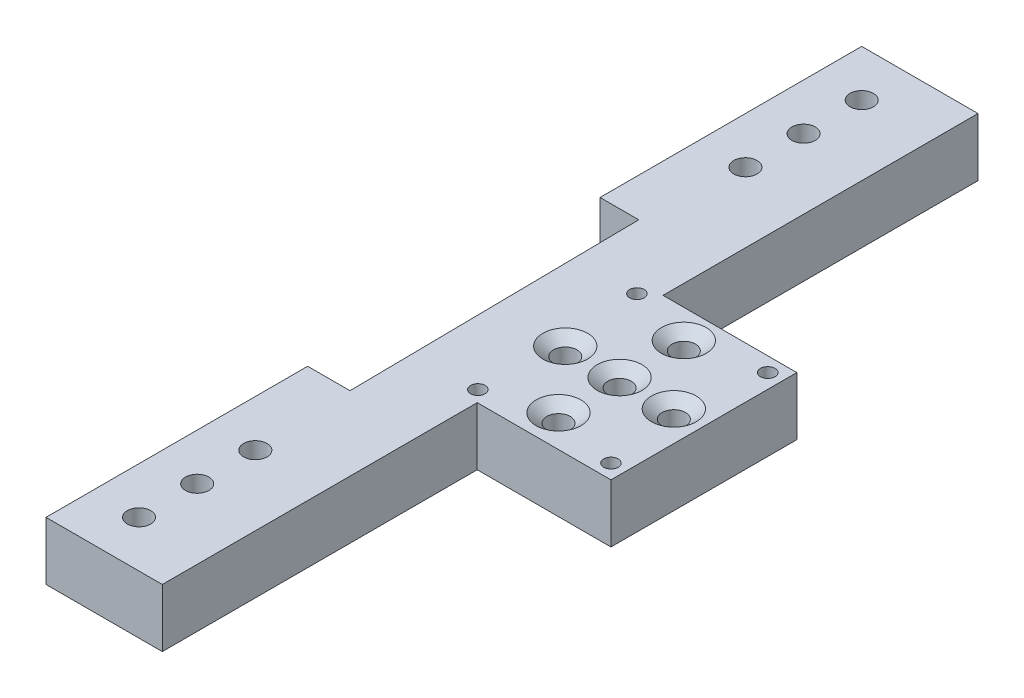
ISO-10303-21;
HEADER;
FILE_DESCRIPTION(('STEP AP214'),'2;1');
FILE_NAME('part.step','',(''),(''),'','','');
FILE_SCHEMA(('AUTOMOTIVE_DESIGN { 1 0 10303 214 1 1 1 1 }'));
ENDSEC;
DATA;
#1=APPLICATION_CONTEXT('core data for automotive mechanical design processes');
#2=APPLICATION_PROTOCOL_DEFINITION('international standard','automotive_design',2000,#1);
#3=PRODUCT_CONTEXT('',#1,'mechanical');
#4=PRODUCT('Part','Part','',(#3));
#5=PRODUCT_RELATED_PRODUCT_CATEGORY('part','',(#4));
#6=PRODUCT_DEFINITION_FORMATION('','',#4);
#7=PRODUCT_DEFINITION_CONTEXT('part definition',#1,'design');
#8=PRODUCT_DEFINITION('design','',#6,#7);
#9=PRODUCT_DEFINITION_SHAPE('','',#8);
#10=(LENGTH_UNIT() NAMED_UNIT(*) SI_UNIT(.MILLI.,.METRE.));
#11=(NAMED_UNIT(*) PLANE_ANGLE_UNIT() SI_UNIT($,.RADIAN.));
#12=(NAMED_UNIT(*) SI_UNIT($,.STERADIAN.) SOLID_ANGLE_UNIT());
#13=UNCERTAINTY_MEASURE_WITH_UNIT(LENGTH_MEASURE(1.E-05),#10,'distance_accuracy_value','');
#14=(GEOMETRIC_REPRESENTATION_CONTEXT(3) GLOBAL_UNCERTAINTY_ASSIGNED_CONTEXT((#13)) GLOBAL_UNIT_ASSIGNED_CONTEXT((#10,
#11,#12)) REPRESENTATION_CONTEXT('',''));
#15=CARTESIAN_POINT('',(0.,0.,0.));
#16=DIRECTION('',(0.,0.,1.));
#17=DIRECTION('',(1.,0.,0.));
#18=AXIS2_PLACEMENT_3D('',#15,#16,#17);
#19=CARTESIAN_POINT('',(0.,12.7,0.));
#20=DIRECTION('',(0.,-1.,0.));
#21=DIRECTION('',(0.,0.,-1.));
#22=AXIS2_PLACEMENT_3D('',#19,#20,#21);
#23=PLANE('',#22);
#24=CARTESIAN_POINT('',(9.37630807243948,12.7,45.9232));
#25=DIRECTION('',(0.,1.,0.));
#26=DIRECTION('',(0.,0.,1.));
#27=AXIS2_PLACEMENT_3D('',#24,#25,#26);
#28=CIRCLE('',#27,2.5527);
#29=CARTESIAN_POINT('',(9.37630807243948,12.7,48.4759));
#30=VERTEX_POINT('',#29);
#31=EDGE_CURVE('E307',#30,#30,#28,.T.);
#32=ORIENTED_EDGE('',*,*,#31,.F.);
#33=EDGE_LOOP('',(#32));
#34=FACE_BOUND('',#33,.T.);
#35=CARTESIAN_POINT('',(9.37630807243948,12.7,-86.5124));
#36=DIRECTION('',(0.,1.,0.));
#37=DIRECTION('',(0.,0.,1.));
#38=AXIS2_PLACEMENT_3D('',#35,#36,#37);
#39=CIRCLE('',#38,2.5527);
#40=CARTESIAN_POINT('',(9.37630807243948,12.7,-83.9597));
#41=VERTEX_POINT('',#40);
#42=EDGE_CURVE('E313',#41,#41,#39,.T.);
#43=ORIENTED_EDGE('',*,*,#42,.F.);
#44=EDGE_LOOP('',(#43));
#45=FACE_BOUND('',#44,.T.);
#46=CARTESIAN_POINT('',(9.37630807243948,12.7,-99.2124));
#47=DIRECTION('',(0.,1.,0.));
#48=DIRECTION('',(0.,0.,1.));
#49=AXIS2_PLACEMENT_3D('',#46,#47,#48);
#50=CIRCLE('',#49,2.5527);
#51=CARTESIAN_POINT('',(9.37630807243948,12.7,-96.6597));
#52=VERTEX_POINT('',#51);
#53=EDGE_CURVE('E325',#52,#52,#50,.T.);
#54=ORIENTED_EDGE('',*,*,#53,.F.);
#55=EDGE_LOOP('',(#54));
#56=FACE_BOUND('',#55,.T.);
#57=DIRECTION('',(0.,0.,-1.));
#58=VECTOR('',#57,1.);
#59=CARTESIAN_POINT('',(24.6163080724395,12.7,0.));
#60=LINE('',#59,#58);
#61=CARTESIAN_POINT('',(24.6163080724395,12.7,68.7832));
#62=VERTEX_POINT('',#61);
#63=CARTESIAN_POINT('',(24.6163080724395,12.7,0.));
#64=VERTEX_POINT('',#63);
#65=EDGE_CURVE('E178',#62,#64,#60,.T.);
#66=ORIENTED_EDGE('',*,*,#65,.T.);
#67=DIRECTION('',(1.,0.,0.));
#68=VECTOR('',#67,1.);
#69=CARTESIAN_POINT('',(24.6163080724395,12.7,0.));
#70=LINE('',#69,#68);
#71=CARTESIAN_POINT('',(53.8263080724395,12.7,0.));
#72=VERTEX_POINT('',#71);
#73=EDGE_CURVE('E106',#64,#72,#70,.T.);
#74=ORIENTED_EDGE('',*,*,#73,.T.);
#75=DIRECTION('',(0.,0.,-1.));
#76=VECTOR('',#75,1.);
#77=CARTESIAN_POINT('',(53.8263080724395,12.7,0.));
#78=LINE('',#77,#76);
#79=CARTESIAN_POINT('',(53.8263080724395,12.7,-40.5892));
#80=VERTEX_POINT('',#79);
#81=EDGE_CURVE('E332',#72,#80,#78,.T.);
#82=ORIENTED_EDGE('',*,*,#81,.T.);
#83=DIRECTION('',(-1.,0.,0.));
#84=VECTOR('',#83,1.);
#85=CARTESIAN_POINT('',(53.8263080724395,12.7,-40.5892));
#86=LINE('',#85,#84);
#87=CARTESIAN_POINT('',(24.6163080724395,12.7,-40.5892));
#88=VERTEX_POINT('',#87);
#89=EDGE_CURVE('E334',#80,#88,#86,.T.);
#90=ORIENTED_EDGE('',*,*,#89,.T.);
#91=DIRECTION('',(0.,0.,-1.));
#92=VECTOR('',#91,1.);
#93=CARTESIAN_POINT('',(24.6163080724395,12.7,-40.5892));
#94=LINE('',#93,#92);
#95=CARTESIAN_POINT('',(24.6163080724395,12.7,-109.3724));
#96=VERTEX_POINT('',#95);
#97=EDGE_CURVE('E336',#88,#96,#94,.T.);
#98=ORIENTED_EDGE('',*,*,#97,.T.);
#99=DIRECTION('',(-1.,0.,0.));
#100=VECTOR('',#99,1.);
#101=CARTESIAN_POINT('',(24.6163080724395,12.7,-109.3724));
#102=LINE('',#101,#100);
#103=CARTESIAN_POINT('',(-0.783691927560525,12.7,-109.3724));
#104=VERTEX_POINT('',#103);
#105=EDGE_CURVE('E338',#96,#104,#102,.T.);
#106=ORIENTED_EDGE('',*,*,#105,.T.);
#107=DIRECTION('',(0.,0.,1.));
#108=VECTOR('',#107,1.);
#109=CARTESIAN_POINT('',(-0.783691927560525,12.7,-109.3724));
#110=LINE('',#109,#108);
#111=CARTESIAN_POINT('',(-0.783691927560517,12.7,-52.2224));
#112=VERTEX_POINT('',#111);
#113=EDGE_CURVE('E340',#104,#112,#110,.T.);
#114=ORIENTED_EDGE('',*,*,#113,.T.);
#115=DIRECTION('',(1.,0.,0.));
#116=VECTOR('',#115,1.);
#117=CARTESIAN_POINT('',(-0.783691927560517,12.7,-52.2224));
#118=LINE('',#117,#116);
#119=CARTESIAN_POINT('',(7.67450807243948,12.7,-52.2224));
#120=VERTEX_POINT('',#119);
#121=EDGE_CURVE('E342',#112,#120,#118,.T.);
#122=ORIENTED_EDGE('',*,*,#121,.T.);
#123=DIRECTION('',(0.0122719528594568,0.,0.999924696751218));
#124=VECTOR('',#123,1.);
#125=CARTESIAN_POINT('',(7.67450807243948,12.7,-52.2224));
#126=LINE('',#125,#124);
#127=CARTESIAN_POINT('',(8.4582,12.7,11.6332));
#128=VERTEX_POINT('',#127);
#129=EDGE_CURVE('E137',#120,#128,#126,.T.);
#130=ORIENTED_EDGE('',*,*,#129,.T.);
#131=DIRECTION('',(-1.,0.,0.));
#132=VECTOR('',#131,1.);
#133=CARTESIAN_POINT('',(-0.783691927560518,12.7,11.6332));
#134=LINE('',#133,#132);
#135=CARTESIAN_POINT('',(-0.783691927560518,12.7,11.6332));
#136=VERTEX_POINT('',#135);
#137=EDGE_CURVE('E131',#128,#136,#134,.T.);
#138=ORIENTED_EDGE('',*,*,#137,.T.);
#139=DIRECTION('',(0.,0.,1.));
#140=VECTOR('',#139,1.);
#141=CARTESIAN_POINT('',(-0.783691927560518,12.7,68.7832));
#142=LINE('',#141,#140);
#143=CARTESIAN_POINT('',(-0.783691927560518,12.7,68.7832));
#144=VERTEX_POINT('',#143);
#145=EDGE_CURVE('E135',#136,#144,#142,.T.);
#146=ORIENTED_EDGE('',*,*,#145,.T.);
#147=DIRECTION('',(1.,0.,0.));
#148=VECTOR('',#147,1.);
#149=CARTESIAN_POINT('',(24.6163080724395,12.7,68.7832));
#150=LINE('',#149,#148);
#151=EDGE_CURVE('E50',#144,#62,#150,.T.);
#152=ORIENTED_EDGE('',*,*,#151,.T.);
#153=EDGE_LOOP('',(#66,#74,#82,#90,#98,#106,#114,#122,#130,#138,#146,#152));
#154=FACE_BOUND('',#153,.T.);
#155=CARTESIAN_POINT('',(9.37630807243948,12.7,58.6232));
#156=DIRECTION('',(0.,1.,0.));
#157=DIRECTION('',(0.,0.,1.));
#158=AXIS2_PLACEMENT_3D('',#155,#156,#157);
#159=CIRCLE('',#158,2.5527);
#160=CARTESIAN_POINT('',(9.37630807243948,12.7,61.1759));
#161=VERTEX_POINT('',#160);
#162=EDGE_CURVE('E319',#161,#161,#159,.T.);
#163=ORIENTED_EDGE('',*,*,#162,.F.);
#164=EDGE_LOOP('',(#163));
#165=FACE_BOUND('',#164,.T.);
#166=CARTESIAN_POINT('',(9.37630807243948,12.7,-73.8124));
#167=DIRECTION('',(0.,1.,0.));
#168=DIRECTION('',(0.,0.,1.));
#169=AXIS2_PLACEMENT_3D('',#166,#167,#168);
#170=CIRCLE('',#169,2.5527);
#171=CARTESIAN_POINT('',(9.37630807243948,12.7,-71.2597));
#172=VERTEX_POINT('',#171);
#173=EDGE_CURVE('E205',#172,#172,#170,.T.);
#174=ORIENTED_EDGE('',*,*,#173,.F.);
#175=EDGE_LOOP('',(#174));
#176=FACE_BOUND('',#175,.T.);
#177=CARTESIAN_POINT('',(9.37630807243948,12.7,33.2232));
#178=DIRECTION('',(0.,1.,0.));
#179=DIRECTION('',(0.,0.,1.));
#180=AXIS2_PLACEMENT_3D('',#177,#178,#179);
#181=CIRCLE('',#180,2.5527);
#182=CARTESIAN_POINT('',(9.37630807243948,12.7,35.7759));
#183=VERTEX_POINT('',#182);
#184=EDGE_CURVE('E42',#183,#183,#181,.T.);
#185=ORIENTED_EDGE('',*,*,#184,.F.);
#186=EDGE_LOOP('',(#185));
#187=FACE_BOUND('',#186,.T.);
#188=CARTESIAN_POINT('',(35.4113080724395,12.7,-6.9607434886059));
#189=DIRECTION('',(0.,1.,0.));
#190=DIRECTION('',(0.,0.,1.));
#191=AXIS2_PLACEMENT_3D('',#188,#189,#190);
#192=CIRCLE('',#191,4.8895);
#193=CARTESIAN_POINT('',(35.4113080724395,12.7,-2.07124348860591));
#194=VERTEX_POINT('',#193);
#195=EDGE_CURVE('E222',#194,#194,#192,.T.);
#196=ORIENTED_EDGE('',*,*,#195,.F.);
#197=EDGE_LOOP('',(#196));
#198=FACE_BOUND('',#197,.T.);
#199=CARTESIAN_POINT('',(35.4113080724395,12.7,-34.3261735415921));
#200=DIRECTION('',(0.,1.,0.));
#201=DIRECTION('',(0.,0.,1.));
#202=AXIS2_PLACEMENT_3D('',#199,#200,#201);
#203=CIRCLE('',#202,4.8895);
#204=CARTESIAN_POINT('',(35.4113080724395,12.7,-29.4366735415921));
#205=VERTEX_POINT('',#204);
#206=EDGE_CURVE('E226',#205,#205,#203,.T.);
#207=ORIENTED_EDGE('',*,*,#206,.F.);
#208=EDGE_LOOP('',(#207));
#209=FACE_BOUND('',#208,.T.);
#210=CARTESIAN_POINT('',(35.4113080724395,12.7,-20.2946));
#211=DIRECTION('',(0.,1.,0.));
#212=DIRECTION('',(0.,0.,1.));
#213=AXIS2_PLACEMENT_3D('',#210,#211,#212);
#214=CIRCLE('',#213,4.8895);
#215=CARTESIAN_POINT('',(35.4113080724395,12.7,-15.4051));
#216=VERTEX_POINT('',#215);
#217=EDGE_CURVE('E230',#216,#216,#214,.T.);
#218=ORIENTED_EDGE('',*,*,#217,.F.);
#219=EDGE_LOOP('',(#218));
#220=FACE_BOUND('',#219,.T.);
#221=CARTESIAN_POINT('',(50.6513080724395,12.7,-37.4142));
#222=DIRECTION('',(0.,1.,0.));
#223=DIRECTION('',(0.,0.,1.));
#224=AXIS2_PLACEMENT_3D('',#221,#222,#223);
#225=CIRCLE('',#224,1.58749999999999);
#226=CARTESIAN_POINT('',(50.6513080724395,12.7,-35.8267));
#227=VERTEX_POINT('',#226);
#228=EDGE_CURVE('E234',#227,#227,#225,.T.);
#229=ORIENTED_EDGE('',*,*,#228,.F.);
#230=EDGE_LOOP('',(#229));
#231=FACE_BOUND('',#230,.T.);
#232=CARTESIAN_POINT('',(50.6513080724395,12.7,-3.175));
#233=DIRECTION('',(0.,1.,0.));
#234=DIRECTION('',(0.,0.,1.));
#235=AXIS2_PLACEMENT_3D('',#232,#233,#234);
#236=CIRCLE('',#235,1.58749999999999);
#237=CARTESIAN_POINT('',(50.6513080724395,12.7,-1.58750000000001));
#238=VERTEX_POINT('',#237);
#239=EDGE_CURVE('E238',#238,#238,#236,.T.);
#240=ORIENTED_EDGE('',*,*,#239,.F.);
#241=EDGE_LOOP('',(#240));
#242=FACE_BOUND('',#241,.T.);
#243=CARTESIAN_POINT('',(22.2141780289218,12.7,-2.54));
#244=DIRECTION('',(0.,1.,0.));
#245=DIRECTION('',(0.,0.,1.));
#246=AXIS2_PLACEMENT_3D('',#243,#244,#245);
#247=CIRCLE('',#246,1.58749999999999);
#248=CARTESIAN_POINT('',(22.2141780289218,12.7,-0.952500000000012));
#249=VERTEX_POINT('',#248);
#250=EDGE_CURVE('E242',#249,#249,#247,.T.);
#251=ORIENTED_EDGE('',*,*,#250,.F.);
#252=EDGE_LOOP('',(#251));
#253=FACE_BOUND('',#252,.T.);
#254=CARTESIAN_POINT('',(21.4413080724395,12.7,-38.0492));
#255=DIRECTION('',(0.,1.,0.));
#256=DIRECTION('',(0.,0.,1.));
#257=AXIS2_PLACEMENT_3D('',#254,#255,#256);
#258=CIRCLE('',#257,1.58749999999999);
#259=CARTESIAN_POINT('',(21.4413080724395,12.7,-36.4617));
#260=VERTEX_POINT('',#259);
#261=EDGE_CURVE('E246',#260,#260,#258,.T.);
#262=ORIENTED_EDGE('',*,*,#261,.F.);
#263=EDGE_LOOP('',(#262));
#264=FACE_BOUND('',#263,.T.);
#265=CARTESIAN_POINT('',(23.5448445186226,12.7,-20.2946));
#266=DIRECTION('',(0.,1.,0.));
#267=DIRECTION('',(0.,0.,1.));
#268=AXIS2_PLACEMENT_3D('',#265,#266,#267);
#269=CIRCLE('',#268,4.8895);
#270=CARTESIAN_POINT('',(23.5448445186226,12.7,-15.4051));
#271=VERTEX_POINT('',#270);
#272=EDGE_CURVE('E250',#271,#271,#269,.T.);
#273=ORIENTED_EDGE('',*,*,#272,.F.);
#274=EDGE_LOOP('',(#273));
#275=FACE_BOUND('',#274,.T.);
#276=CARTESIAN_POINT('',(47.2605410846303,12.7,-20.2946));
#277=DIRECTION('',(0.,1.,0.));
#278=DIRECTION('',(0.,0.,1.));
#279=AXIS2_PLACEMENT_3D('',#276,#277,#278);
#280=CIRCLE('',#279,4.8895);
#281=CARTESIAN_POINT('',(47.2605410846303,12.7,-15.4051));
#282=VERTEX_POINT('',#281);
#283=EDGE_CURVE('E253',#282,#282,#280,.T.);
#284=ORIENTED_EDGE('',*,*,#283,.F.);
#285=EDGE_LOOP('',(#284));
#286=FACE_BOUND('',#285,.T.);
#287=ADVANCED_FACE('F33',(#34,#45,#56,#154,#165,#176,#187,#198,#209,#220,#231,#242,#253,#264,
#275,#286),#23,.F.);
#288=CARTESIAN_POINT('',(9.37630807243948,12.7,33.2232));
#289=DIRECTION('',(0.,1.,0.));
#290=DIRECTION('',(0.,0.,1.));
#291=AXIS2_PLACEMENT_3D('',#288,#289,#290);
#292=CYLINDRICAL_SURFACE('',#291,2.5527);
#293=ORIENTED_EDGE('',*,*,#184,.T.);
#294=EDGE_LOOP('',(#293));
#295=FACE_BOUND('',#294,.T.);
#296=CARTESIAN_POINT('',(9.37630807243948,0.,33.2232));
#297=DIRECTION('',(0.,-1.,0.));
#298=DIRECTION('',(0.,0.,-1.));
#299=AXIS2_PLACEMENT_3D('',#296,#297,#298);
#300=CIRCLE('',#299,2.5527);
#301=CARTESIAN_POINT('',(9.37630807243948,0.,30.6705));
#302=VERTEX_POINT('',#301);
#303=EDGE_CURVE('E11',#302,#302,#300,.T.);
#304=ORIENTED_EDGE('',*,*,#303,.T.);
#305=EDGE_LOOP('',(#304));
#306=FACE_BOUND('',#305,.T.);
#307=ADVANCED_FACE('F35',(#295,#306),#292,.F.);
#308=CARTESIAN_POINT('',(9.37630807243948,12.7,-73.8124));
#309=DIRECTION('',(0.,1.,0.));
#310=DIRECTION('',(0.,0.,1.));
#311=AXIS2_PLACEMENT_3D('',#308,#309,#310);
#312=CYLINDRICAL_SURFACE('',#311,2.5527);
#313=ORIENTED_EDGE('',*,*,#173,.T.);
#314=EDGE_LOOP('',(#313));
#315=FACE_BOUND('',#314,.T.);
#316=CARTESIAN_POINT('',(9.37630807243948,0.,-73.8124));
#317=DIRECTION('',(0.,-1.,0.));
#318=DIRECTION('',(0.,0.,-1.));
#319=AXIS2_PLACEMENT_3D('',#316,#317,#318);
#320=CIRCLE('',#319,2.5527);
#321=CARTESIAN_POINT('',(9.37630807243948,0.,-76.3651));
#322=VERTEX_POINT('',#321);
#323=EDGE_CURVE('E208',#322,#322,#320,.T.);
#324=ORIENTED_EDGE('',*,*,#323,.T.);
#325=EDGE_LOOP('',(#324));
#326=FACE_BOUND('',#325,.T.);
#327=ADVANCED_FACE('F404',(#315,#326),#312,.F.);
#328=CARTESIAN_POINT('',(24.6163080724395,12.7,0.));
#329=DIRECTION('',(-1.,0.,0.));
#330=DIRECTION('',(0.,0.,1.));
#331=AXIS2_PLACEMENT_3D('',#328,#329,#330);
#332=PLANE('',#331);
#333=DIRECTION('',(0.,0.,-1.));
#334=VECTOR('',#333,1.);
#335=CARTESIAN_POINT('',(24.6163080724395,0.,0.));
#336=LINE('',#335,#334);
#337=CARTESIAN_POINT('',(24.6163080724395,0.,68.7832));
#338=VERTEX_POINT('',#337);
#339=CARTESIAN_POINT('',(24.6163080724395,0.,0.));
#340=VERTEX_POINT('',#339);
#341=EDGE_CURVE('E155',#338,#340,#336,.T.);
#342=ORIENTED_EDGE('',*,*,#341,.T.);
#343=DIRECTION('',(0.,-1.,0.));
#344=VECTOR('',#343,1.);
#345=CARTESIAN_POINT('',(24.6163080724395,12.7,0.));
#346=LINE('',#345,#344);
#347=EDGE_CURVE('E203',#64,#340,#346,.T.);
#348=ORIENTED_EDGE('',*,*,#347,.F.);
#349=ORIENTED_EDGE('',*,*,#65,.F.);
#350=DIRECTION('',(0.,-1.,0.));
#351=VECTOR('',#350,1.);
#352=CARTESIAN_POINT('',(24.6163080724395,12.7,68.7832));
#353=LINE('',#352,#351);
#354=EDGE_CURVE('E151',#62,#338,#353,.T.);
#355=ORIENTED_EDGE('',*,*,#354,.T.);
#356=EDGE_LOOP('',(#342,#348,#349,#355));
#357=FACE_BOUND('',#356,.T.);
#358=ADVANCED_FACE('F360',(#357),#332,.F.);
#359=CARTESIAN_POINT('',(24.6163080724395,12.7,0.));
#360=DIRECTION('',(0.,0.,-1.));
#361=DIRECTION('',(-1.,0.,0.));
#362=AXIS2_PLACEMENT_3D('',#359,#360,#361);
#363=PLANE('',#362);
#364=DIRECTION('',(1.,0.,0.));
#365=VECTOR('',#364,1.);
#366=CARTESIAN_POINT('',(24.6163080724395,0.,0.));
#367=LINE('',#366,#365);
#368=CARTESIAN_POINT('',(53.8263080724395,0.,0.));
#369=VERTEX_POINT('',#368);
#370=EDGE_CURVE('E158',#340,#369,#367,.T.);
#371=ORIENTED_EDGE('',*,*,#370,.T.);
#372=DIRECTION('',(0.,-1.,0.));
#373=VECTOR('',#372,1.);
#374=CARTESIAN_POINT('',(53.8263080724395,12.7,0.));
#375=LINE('',#374,#373);
#376=EDGE_CURVE('E200',#72,#369,#375,.T.);
#377=ORIENTED_EDGE('',*,*,#376,.F.);
#378=ORIENTED_EDGE('',*,*,#73,.F.);
#379=ORIENTED_EDGE('',*,*,#347,.T.);
#380=EDGE_LOOP('',(#371,#377,#378,#379));
#381=FACE_BOUND('',#380,.T.);
#382=ADVANCED_FACE('F399',(#381),#363,.F.);
#383=CARTESIAN_POINT('',(53.8263080724395,12.7,0.));
#384=DIRECTION('',(-1.,0.,0.));
#385=DIRECTION('',(0.,0.,1.));
#386=AXIS2_PLACEMENT_3D('',#383,#384,#385);
#387=PLANE('',#386);
#388=DIRECTION('',(0.,0.,-1.));
#389=VECTOR('',#388,1.);
#390=CARTESIAN_POINT('',(53.8263080724395,0.,0.));
#391=LINE('',#390,#389);
#392=CARTESIAN_POINT('',(53.8263080724395,0.,-40.5892));
#393=VERTEX_POINT('',#392);
#394=EDGE_CURVE('E161',#369,#393,#391,.T.);
#395=ORIENTED_EDGE('',*,*,#394,.T.);
#396=DIRECTION('',(0.,-1.,0.));
#397=VECTOR('',#396,1.);
#398=CARTESIAN_POINT('',(53.8263080724395,12.7,-40.5892));
#399=LINE('',#398,#397);
#400=EDGE_CURVE('E197',#80,#393,#399,.T.);
#401=ORIENTED_EDGE('',*,*,#400,.F.);
#402=ORIENTED_EDGE('',*,*,#81,.F.);
#403=ORIENTED_EDGE('',*,*,#376,.T.);
#404=EDGE_LOOP('',(#395,#401,#402,#403));
#405=FACE_BOUND('',#404,.T.);
#406=ADVANCED_FACE('F395',(#405),#387,.F.);
#407=CARTESIAN_POINT('',(53.8263080724395,12.7,-40.5892));
#408=DIRECTION('',(0.,0.,1.));
#409=DIRECTION('',(1.,0.,0.));
#410=AXIS2_PLACEMENT_3D('',#407,#408,#409);
#411=PLANE('',#410);
#412=DIRECTION('',(-1.,0.,0.));
#413=VECTOR('',#412,1.);
#414=CARTESIAN_POINT('',(53.8263080724395,0.,-40.5892));
#415=LINE('',#414,#413);
#416=CARTESIAN_POINT('',(24.6163080724395,0.,-40.5892));
#417=VERTEX_POINT('',#416);
#418=EDGE_CURVE('E163',#393,#417,#415,.T.);
#419=ORIENTED_EDGE('',*,*,#418,.T.);
#420=DIRECTION('',(0.,-1.,0.));
#421=VECTOR('',#420,1.);
#422=CARTESIAN_POINT('',(24.6163080724395,12.7,-40.5892));
#423=LINE('',#422,#421);
#424=EDGE_CURVE('E194',#88,#417,#423,.T.);
#425=ORIENTED_EDGE('',*,*,#424,.F.);
#426=ORIENTED_EDGE('',*,*,#89,.F.);
#427=ORIENTED_EDGE('',*,*,#400,.T.);
#428=EDGE_LOOP('',(#419,#425,#426,#427));
#429=FACE_BOUND('',#428,.T.);
#430=ADVANCED_FACE('F391',(#429),#411,.F.);
#431=CARTESIAN_POINT('',(24.6163080724395,12.7,-40.5892));
#432=DIRECTION('',(-1.,0.,0.));
#433=DIRECTION('',(0.,0.,1.));
#434=AXIS2_PLACEMENT_3D('',#431,#432,#433);
#435=PLANE('',#434);
#436=DIRECTION('',(0.,0.,-1.));
#437=VECTOR('',#436,1.);
#438=CARTESIAN_POINT('',(24.6163080724395,0.,-40.5892));
#439=LINE('',#438,#437);
#440=CARTESIAN_POINT('',(24.6163080724395,0.,-109.3724));
#441=VERTEX_POINT('',#440);
#442=EDGE_CURVE('E165',#417,#441,#439,.T.);
#443=ORIENTED_EDGE('',*,*,#442,.T.);
#444=DIRECTION('',(0.,-1.,0.));
#445=VECTOR('',#444,1.);
#446=CARTESIAN_POINT('',(24.6163080724395,12.7,-109.3724));
#447=LINE('',#446,#445);
#448=EDGE_CURVE('E191',#96,#441,#447,.T.);
#449=ORIENTED_EDGE('',*,*,#448,.F.);
#450=ORIENTED_EDGE('',*,*,#97,.F.);
#451=ORIENTED_EDGE('',*,*,#424,.T.);
#452=EDGE_LOOP('',(#443,#449,#450,#451));
#453=FACE_BOUND('',#452,.T.);
#454=ADVANCED_FACE('F387',(#453),#435,.F.);
#455=CARTESIAN_POINT('',(24.6163080724395,12.7,-109.3724));
#456=DIRECTION('',(0.,0.,1.));
#457=DIRECTION('',(1.,0.,0.));
#458=AXIS2_PLACEMENT_3D('',#455,#456,#457);
#459=PLANE('',#458);
#460=DIRECTION('',(-1.,0.,0.));
#461=VECTOR('',#460,1.);
#462=CARTESIAN_POINT('',(24.6163080724395,0.,-109.3724));
#463=LINE('',#462,#461);
#464=CARTESIAN_POINT('',(-0.783691927560525,0.,-109.3724));
#465=VERTEX_POINT('',#464);
#466=EDGE_CURVE('E167',#441,#465,#463,.T.);
#467=ORIENTED_EDGE('',*,*,#466,.T.);
#468=DIRECTION('',(0.,-1.,0.));
#469=VECTOR('',#468,1.);
#470=CARTESIAN_POINT('',(-0.783691927560525,12.7,-109.3724));
#471=LINE('',#470,#469);
#472=EDGE_CURVE('E188',#104,#465,#471,.T.);
#473=ORIENTED_EDGE('',*,*,#472,.F.);
#474=ORIENTED_EDGE('',*,*,#105,.F.);
#475=ORIENTED_EDGE('',*,*,#448,.T.);
#476=EDGE_LOOP('',(#467,#473,#474,#475));
#477=FACE_BOUND('',#476,.T.);
#478=ADVANCED_FACE('F383',(#477),#459,.F.);
#479=CARTESIAN_POINT('',(-0.783691927560525,12.7,-109.3724));
#480=DIRECTION('',(1.,0.,0.));
#481=DIRECTION('',(0.,0.,-1.));
#482=AXIS2_PLACEMENT_3D('',#479,#480,#481);
#483=PLANE('',#482);
#484=DIRECTION('',(0.,0.,1.));
#485=VECTOR('',#484,1.);
#486=CARTESIAN_POINT('',(-0.783691927560525,0.,-109.3724));
#487=LINE('',#486,#485);
#488=CARTESIAN_POINT('',(-0.783691927560517,0.,-52.2224));
#489=VERTEX_POINT('',#488);
#490=EDGE_CURVE('E169',#465,#489,#487,.T.);
#491=ORIENTED_EDGE('',*,*,#490,.T.);
#492=DIRECTION('',(0.,-1.,0.));
#493=VECTOR('',#492,1.);
#494=CARTESIAN_POINT('',(-0.783691927560517,12.7,-52.2224));
#495=LINE('',#494,#493);
#496=EDGE_CURVE('E185',#112,#489,#495,.T.);
#497=ORIENTED_EDGE('',*,*,#496,.F.);
#498=ORIENTED_EDGE('',*,*,#113,.F.);
#499=ORIENTED_EDGE('',*,*,#472,.T.);
#500=EDGE_LOOP('',(#491,#497,#498,#499));
#501=FACE_BOUND('',#500,.T.);
#502=ADVANCED_FACE('F380',(#501),#483,.F.);
#503=CARTESIAN_POINT('',(-0.783691927560517,12.7,-52.2224));
#504=DIRECTION('',(0.,0.,-1.));
#505=DIRECTION('',(-1.,0.,0.));
#506=AXIS2_PLACEMENT_3D('',#503,#504,#505);
#507=PLANE('',#506);
#508=DIRECTION('',(1.,0.,0.));
#509=VECTOR('',#508,1.);
#510=CARTESIAN_POINT('',(-0.783691927560517,0.,-52.2224));
#511=LINE('',#510,#509);
#512=CARTESIAN_POINT('',(7.67450807243948,0.,-52.2224));
#513=VERTEX_POINT('',#512);
#514=EDGE_CURVE('E171',#489,#513,#511,.T.);
#515=ORIENTED_EDGE('',*,*,#514,.T.);
#516=DIRECTION('',(0.,-1.,0.));
#517=VECTOR('',#516,1.);
#518=CARTESIAN_POINT('',(7.67450807243948,12.7,-52.2224));
#519=LINE('',#518,#517);
#520=EDGE_CURVE('E182',#120,#513,#519,.T.);
#521=ORIENTED_EDGE('',*,*,#520,.F.);
#522=ORIENTED_EDGE('',*,*,#121,.F.);
#523=ORIENTED_EDGE('',*,*,#496,.T.);
#524=EDGE_LOOP('',(#515,#521,#522,#523));
#525=FACE_BOUND('',#524,.T.);
#526=ADVANCED_FACE('F348',(#525),#507,.F.);
#527=CARTESIAN_POINT('',(7.67450807243948,12.7,-52.2224));
#528=DIRECTION('',(0.999924696751218,0.,-0.0122719528594568));
#529=DIRECTION('',(-0.0122719528594568,0.,-0.999924696751218));
#530=AXIS2_PLACEMENT_3D('',#527,#528,#529);
#531=PLANE('',#530);
#532=DIRECTION('',(0.0122719528594568,0.,0.999924696751218));
#533=VECTOR('',#532,1.);
#534=CARTESIAN_POINT('',(7.67450807243948,0.,-52.2224));
#535=LINE('',#534,#533);
#536=CARTESIAN_POINT('',(8.4582,0.,11.6332));
#537=VERTEX_POINT('',#536);
#538=EDGE_CURVE('E173',#513,#537,#535,.T.);
#539=ORIENTED_EDGE('',*,*,#538,.T.);
#540=DIRECTION('',(0.,-1.,0.));
#541=VECTOR('',#540,1.);
#542=CARTESIAN_POINT('',(8.4582,12.7,11.6332));
#543=LINE('',#542,#541);
#544=EDGE_CURVE('E146',#128,#537,#543,.T.);
#545=ORIENTED_EDGE('',*,*,#544,.F.);
#546=ORIENTED_EDGE('',*,*,#129,.F.);
#547=ORIENTED_EDGE('',*,*,#520,.T.);
#548=EDGE_LOOP('',(#539,#545,#546,#547));
#549=FACE_BOUND('',#548,.T.);
#550=ADVANCED_FACE('F352',(#549),#531,.F.);
#551=CARTESIAN_POINT('',(-0.783691927560518,12.7,11.6332));
#552=DIRECTION('',(0.,0.,1.));
#553=DIRECTION('',(1.,0.,0.));
#554=AXIS2_PLACEMENT_3D('',#551,#552,#553);
#555=PLANE('',#554);
#556=DIRECTION('',(-1.,0.,0.));
#557=VECTOR('',#556,1.);
#558=CARTESIAN_POINT('',(-0.783691927560518,0.,11.6332));
#559=LINE('',#558,#557);
#560=CARTESIAN_POINT('',(-0.783691927560518,0.,11.6332));
#561=VERTEX_POINT('',#560);
#562=EDGE_CURVE('E145',#537,#561,#559,.T.);
#563=ORIENTED_EDGE('',*,*,#562,.T.);
#564=DIRECTION('',(0.,-1.,0.));
#565=VECTOR('',#564,1.);
#566=CARTESIAN_POINT('',(-0.783691927560518,12.7,11.6332));
#567=LINE('',#566,#565);
#568=EDGE_CURVE('E142',#136,#561,#567,.T.);
#569=ORIENTED_EDGE('',*,*,#568,.F.);
#570=ORIENTED_EDGE('',*,*,#137,.F.);
#571=ORIENTED_EDGE('',*,*,#544,.T.);
#572=EDGE_LOOP('',(#563,#569,#570,#571));
#573=FACE_BOUND('',#572,.T.);
#574=ADVANCED_FACE('F143',(#573),#555,.F.);
#575=CARTESIAN_POINT('',(-0.783691927560518,12.7,68.7832));
#576=DIRECTION('',(1.,0.,0.));
#577=DIRECTION('',(0.,0.,-1.));
#578=AXIS2_PLACEMENT_3D('',#575,#576,#577);
#579=PLANE('',#578);
#580=DIRECTION('',(0.,0.,1.));
#581=VECTOR('',#580,1.);
#582=CARTESIAN_POINT('',(-0.783691927560518,0.,68.7832));
#583=LINE('',#582,#581);
#584=CARTESIAN_POINT('',(-0.783691927560518,0.,68.7832));
#585=VERTEX_POINT('',#584);
#586=EDGE_CURVE('E91',#561,#585,#583,.T.);
#587=ORIENTED_EDGE('',*,*,#586,.T.);
#588=DIRECTION('',(0.,-1.,0.));
#589=VECTOR('',#588,1.);
#590=CARTESIAN_POINT('',(-0.783691927560518,12.7,68.7832));
#591=LINE('',#590,#589);
#592=EDGE_CURVE('E147',#144,#585,#591,.T.);
#593=ORIENTED_EDGE('',*,*,#592,.F.);
#594=ORIENTED_EDGE('',*,*,#145,.F.);
#595=ORIENTED_EDGE('',*,*,#568,.T.);
#596=EDGE_LOOP('',(#587,#593,#594,#595));
#597=FACE_BOUND('',#596,.T.);
#598=ADVANCED_FACE('F149',(#597),#579,.F.);
#599=CARTESIAN_POINT('',(24.6163080724395,12.7,68.7832));
#600=DIRECTION('',(0.,0.,-1.));
#601=DIRECTION('',(-1.,0.,0.));
#602=AXIS2_PLACEMENT_3D('',#599,#600,#601);
#603=PLANE('',#602);
#604=DIRECTION('',(1.,0.,0.));
#605=VECTOR('',#604,1.);
#606=CARTESIAN_POINT('',(24.6163080724395,0.,68.7832));
#607=LINE('',#606,#605);
#608=EDGE_CURVE('E97',#585,#338,#607,.T.);
#609=ORIENTED_EDGE('',*,*,#608,.T.);
#610=ORIENTED_EDGE('',*,*,#354,.F.);
#611=ORIENTED_EDGE('',*,*,#151,.F.);
#612=ORIENTED_EDGE('',*,*,#592,.T.);
#613=EDGE_LOOP('',(#609,#610,#611,#612));
#614=FACE_BOUND('',#613,.T.);
#615=ADVANCED_FACE('F362',(#614),#603,.F.);
#616=CARTESIAN_POINT('',(0.,0.,0.));
#617=DIRECTION('',(0.,-1.,0.));
#618=DIRECTION('',(0.,0.,-1.));
#619=AXIS2_PLACEMENT_3D('',#616,#617,#618);
#620=PLANE('',#619);
#621=CARTESIAN_POINT('',(47.2605410846303,0.,-20.2946));
#622=DIRECTION('',(0.,-1.,0.));
#623=DIRECTION('',(0.,0.,-1.));
#624=AXIS2_PLACEMENT_3D('',#621,#622,#623);
#625=CIRCLE('',#624,2.5527);
#626=CARTESIAN_POINT('',(47.2605410846303,0.,-22.8473));
#627=VERTEX_POINT('',#626);
#628=EDGE_CURVE('E258',#627,#627,#625,.T.);
#629=ORIENTED_EDGE('',*,*,#628,.F.);
#630=EDGE_LOOP('',(#629));
#631=FACE_BOUND('',#630,.T.);
#632=CARTESIAN_POINT('',(23.5448445186226,0.,-20.2946));
#633=DIRECTION('',(0.,-1.,0.));
#634=DIRECTION('',(0.,0.,-1.));
#635=AXIS2_PLACEMENT_3D('',#632,#633,#634);
#636=CIRCLE('',#635,2.5527);
#637=CARTESIAN_POINT('',(23.5448445186226,0.,-22.8473));
#638=VERTEX_POINT('',#637);
#639=EDGE_CURVE('E267',#638,#638,#636,.T.);
#640=ORIENTED_EDGE('',*,*,#639,.F.);
#641=EDGE_LOOP('',(#640));
#642=FACE_BOUND('',#641,.T.);
#643=CARTESIAN_POINT('',(21.4413080724395,0.,-38.0492));
#644=DIRECTION('',(0.,-1.,0.));
#645=DIRECTION('',(0.,0.,-1.));
#646=AXIS2_PLACEMENT_3D('',#643,#644,#645);
#647=CIRCLE('',#646,1.58749999999999);
#648=CARTESIAN_POINT('',(21.4413080724395,0.,-39.6367));
#649=VERTEX_POINT('',#648);
#650=EDGE_CURVE('E271',#649,#649,#647,.T.);
#651=ORIENTED_EDGE('',*,*,#650,.F.);
#652=EDGE_LOOP('',(#651));
#653=FACE_BOUND('',#652,.T.);
#654=CARTESIAN_POINT('',(22.2141780289218,0.,-2.54));
#655=DIRECTION('',(0.,-1.,0.));
#656=DIRECTION('',(0.,0.,-1.));
#657=AXIS2_PLACEMENT_3D('',#654,#655,#656);
#658=CIRCLE('',#657,1.58749999999999);
#659=CARTESIAN_POINT('',(22.2141780289218,0.,-4.12749999999999));
#660=VERTEX_POINT('',#659);
#661=EDGE_CURVE('E275',#660,#660,#658,.T.);
#662=ORIENTED_EDGE('',*,*,#661,.F.);
#663=EDGE_LOOP('',(#662));
#664=FACE_BOUND('',#663,.T.);
#665=CARTESIAN_POINT('',(50.6513080724395,0.,-3.175));
#666=DIRECTION('',(0.,-1.,0.));
#667=DIRECTION('',(0.,0.,-1.));
#668=AXIS2_PLACEMENT_3D('',#665,#666,#667);
#669=CIRCLE('',#668,1.5875);
#670=CARTESIAN_POINT('',(50.6513080724395,0.,-4.76249999999999));
#671=VERTEX_POINT('',#670);
#672=EDGE_CURVE('E279',#671,#671,#669,.T.);
#673=ORIENTED_EDGE('',*,*,#672,.F.);
#674=EDGE_LOOP('',(#673));
#675=FACE_BOUND('',#674,.T.);
#676=CARTESIAN_POINT('',(50.6513080724395,0.,-37.4142));
#677=DIRECTION('',(0.,-1.,0.));
#678=DIRECTION('',(0.,0.,-1.));
#679=AXIS2_PLACEMENT_3D('',#676,#677,#678);
#680=CIRCLE('',#679,1.5875);
#681=CARTESIAN_POINT('',(50.6513080724395,0.,-39.0017));
#682=VERTEX_POINT('',#681);
#683=EDGE_CURVE('E283',#682,#682,#680,.T.);
#684=ORIENTED_EDGE('',*,*,#683,.F.);
#685=EDGE_LOOP('',(#684));
#686=FACE_BOUND('',#685,.T.);
#687=CARTESIAN_POINT('',(35.4113080724395,0.,-20.2946));
#688=DIRECTION('',(0.,-1.,0.));
#689=DIRECTION('',(0.,0.,-1.));
#690=AXIS2_PLACEMENT_3D('',#687,#688,#689);
#691=CIRCLE('',#690,2.5527);
#692=CARTESIAN_POINT('',(35.4113080724395,0.,-22.8473));
#693=VERTEX_POINT('',#692);
#694=EDGE_CURVE('E290',#693,#693,#691,.T.);
#695=ORIENTED_EDGE('',*,*,#694,.F.);
#696=EDGE_LOOP('',(#695));
#697=FACE_BOUND('',#696,.T.);
#698=CARTESIAN_POINT('',(35.4113080724395,0.,-34.3261735415921));
#699=DIRECTION('',(0.,-1.,0.));
#700=DIRECTION('',(0.,0.,-1.));
#701=AXIS2_PLACEMENT_3D('',#698,#699,#700);
#702=CIRCLE('',#701,2.5527);
#703=CARTESIAN_POINT('',(35.4113080724395,0.,-36.8788735415921));
#704=VERTEX_POINT('',#703);
#705=EDGE_CURVE('E297',#704,#704,#702,.T.);
#706=ORIENTED_EDGE('',*,*,#705,.F.);
#707=EDGE_LOOP('',(#706));
#708=FACE_BOUND('',#707,.T.);
#709=CARTESIAN_POINT('',(35.4113080724395,0.,-6.9607434886059));
#710=DIRECTION('',(0.,-1.,0.));
#711=DIRECTION('',(0.,0.,-1.));
#712=AXIS2_PLACEMENT_3D('',#709,#710,#711);
#713=CIRCLE('',#712,2.5527);
#714=CARTESIAN_POINT('',(35.4113080724395,0.,-9.5134434886059));
#715=VERTEX_POINT('',#714);
#716=EDGE_CURVE('E304',#715,#715,#713,.T.);
#717=ORIENTED_EDGE('',*,*,#716,.F.);
#718=EDGE_LOOP('',(#717));
#719=FACE_BOUND('',#718,.T.);
#720=CARTESIAN_POINT('',(9.37630807243948,0.,45.9232));
#721=DIRECTION('',(0.,-1.,0.));
#722=DIRECTION('',(0.,0.,-1.));
#723=AXIS2_PLACEMENT_3D('',#720,#721,#722);
#724=CIRCLE('',#723,2.5527);
#725=CARTESIAN_POINT('',(9.37630807243948,0.,43.3705));
#726=VERTEX_POINT('',#725);
#727=EDGE_CURVE('E310',#726,#726,#724,.T.);
#728=ORIENTED_EDGE('',*,*,#727,.F.);
#729=EDGE_LOOP('',(#728));
#730=FACE_BOUND('',#729,.T.);
#731=CARTESIAN_POINT('',(9.37630807243948,0.,-86.5124));
#732=DIRECTION('',(0.,-1.,0.));
#733=DIRECTION('',(0.,0.,-1.));
#734=AXIS2_PLACEMENT_3D('',#731,#732,#733);
#735=CIRCLE('',#734,2.5527);
#736=CARTESIAN_POINT('',(9.37630807243948,0.,-89.0651));
#737=VERTEX_POINT('',#736);
#738=EDGE_CURVE('E316',#737,#737,#735,.T.);
#739=ORIENTED_EDGE('',*,*,#738,.F.);
#740=EDGE_LOOP('',(#739));
#741=FACE_BOUND('',#740,.T.);
#742=CARTESIAN_POINT('',(9.37630807243948,0.,58.6232));
#743=DIRECTION('',(0.,-1.,0.));
#744=DIRECTION('',(0.,0.,-1.));
#745=AXIS2_PLACEMENT_3D('',#742,#743,#744);
#746=CIRCLE('',#745,2.5527);
#747=CARTESIAN_POINT('',(9.37630807243948,0.,56.0705));
#748=VERTEX_POINT('',#747);
#749=EDGE_CURVE('E322',#748,#748,#746,.T.);
#750=ORIENTED_EDGE('',*,*,#749,.F.);
#751=EDGE_LOOP('',(#750));
#752=FACE_BOUND('',#751,.T.);
#753=CARTESIAN_POINT('',(9.37630807243948,0.,-99.2124));
#754=DIRECTION('',(0.,-1.,0.));
#755=DIRECTION('',(0.,0.,-1.));
#756=AXIS2_PLACEMENT_3D('',#753,#754,#755);
#757=CIRCLE('',#756,2.5527);
#758=CARTESIAN_POINT('',(9.37630807243948,0.,-101.7651));
#759=VERTEX_POINT('',#758);
#760=EDGE_CURVE('E159',#759,#759,#757,.T.);
#761=ORIENTED_EDGE('',*,*,#760,.F.);
#762=EDGE_LOOP('',(#761));
#763=FACE_BOUND('',#762,.T.);
#764=ORIENTED_EDGE('',*,*,#341,.F.);
#765=ORIENTED_EDGE('',*,*,#608,.F.);
#766=ORIENTED_EDGE('',*,*,#586,.F.);
#767=ORIENTED_EDGE('',*,*,#562,.F.);
#768=ORIENTED_EDGE('',*,*,#538,.F.);
#769=ORIENTED_EDGE('',*,*,#514,.F.);
#770=ORIENTED_EDGE('',*,*,#490,.F.);
#771=ORIENTED_EDGE('',*,*,#466,.F.);
#772=ORIENTED_EDGE('',*,*,#442,.F.);
#773=ORIENTED_EDGE('',*,*,#418,.F.);
#774=ORIENTED_EDGE('',*,*,#394,.F.);
#775=ORIENTED_EDGE('',*,*,#370,.F.);
#776=EDGE_LOOP('',(#764,#765,#766,#767,#768,#769,#770,#771,#772,#773,#774,#775));
#777=FACE_BOUND('',#776,.T.);
#778=ORIENTED_EDGE('',*,*,#323,.F.);
#779=EDGE_LOOP('',(#778));
#780=FACE_BOUND('',#779,.T.);
#781=ORIENTED_EDGE('',*,*,#303,.F.);
#782=EDGE_LOOP('',(#781));
#783=FACE_BOUND('',#782,.T.);
#784=ADVANCED_FACE('F355',(#631,#642,#653,#664,#675,#686,#697,#708,#719,#730,#741,#752,#763,
#777,#780,#783),#620,.T.);
#785=CARTESIAN_POINT('',(9.37630807243948,12.7,-99.2124));
#786=DIRECTION('',(0.,1.,0.));
#787=DIRECTION('',(0.,0.,1.));
#788=AXIS2_PLACEMENT_3D('',#785,#786,#787);
#789=CYLINDRICAL_SURFACE('',#788,2.5527);
#790=ORIENTED_EDGE('',*,*,#53,.T.);
#791=EDGE_LOOP('',(#790));
#792=FACE_BOUND('',#791,.T.);
#793=ORIENTED_EDGE('',*,*,#760,.T.);
#794=EDGE_LOOP('',(#793));
#795=FACE_BOUND('',#794,.T.);
#796=ADVANCED_FACE('F369',(#792,#795),#789,.F.);
#797=CARTESIAN_POINT('',(9.37630807243948,12.7,58.6232));
#798=DIRECTION('',(0.,1.,0.));
#799=DIRECTION('',(0.,0.,1.));
#800=AXIS2_PLACEMENT_3D('',#797,#798,#799);
#801=CYLINDRICAL_SURFACE('',#800,2.5527);
#802=ORIENTED_EDGE('',*,*,#162,.T.);
#803=EDGE_LOOP('',(#802));
#804=FACE_BOUND('',#803,.T.);
#805=ORIENTED_EDGE('',*,*,#749,.T.);
#806=EDGE_LOOP('',(#805));
#807=FACE_BOUND('',#806,.T.);
#808=ADVANCED_FACE('F530',(#804,#807),#801,.F.);
#809=CARTESIAN_POINT('',(9.37630807243948,12.7,-86.5124));
#810=DIRECTION('',(0.,1.,0.));
#811=DIRECTION('',(0.,0.,1.));
#812=AXIS2_PLACEMENT_3D('',#809,#810,#811);
#813=CYLINDRICAL_SURFACE('',#812,2.5527);
#814=ORIENTED_EDGE('',*,*,#42,.T.);
#815=EDGE_LOOP('',(#814));
#816=FACE_BOUND('',#815,.T.);
#817=ORIENTED_EDGE('',*,*,#738,.T.);
#818=EDGE_LOOP('',(#817));
#819=FACE_BOUND('',#818,.T.);
#820=ADVANCED_FACE('F526',(#816,#819),#813,.F.);
#821=CARTESIAN_POINT('',(9.37630807243948,12.7,45.9232));
#822=DIRECTION('',(0.,1.,0.));
#823=DIRECTION('',(0.,0.,1.));
#824=AXIS2_PLACEMENT_3D('',#821,#822,#823);
#825=CYLINDRICAL_SURFACE('',#824,2.5527);
#826=ORIENTED_EDGE('',*,*,#31,.T.);
#827=EDGE_LOOP('',(#826));
#828=FACE_BOUND('',#827,.T.);
#829=ORIENTED_EDGE('',*,*,#727,.T.);
#830=EDGE_LOOP('',(#829));
#831=FACE_BOUND('',#830,.T.);
#832=ADVANCED_FACE('F522',(#828,#831),#825,.F.);
#833=CARTESIAN_POINT('',(35.4113080724395,12.7,-6.9607434886059));
#834=DIRECTION('',(0.,1.,0.));
#835=DIRECTION('',(0.,0.,1.));
#836=AXIS2_PLACEMENT_3D('',#833,#834,#835);
#837=CYLINDRICAL_SURFACE('',#836,2.5527);
#838=CARTESIAN_POINT('',(35.4113080724395,10.7391919818649,-6.9607434886059));
#839=DIRECTION('',(0.,1.,0.));
#840=DIRECTION('',(0.,0.,1.));
#841=AXIS2_PLACEMENT_3D('',#838,#839,#840);
#842=CIRCLE('',#841,2.5527);
#843=CARTESIAN_POINT('',(35.4113080724395,10.7391919818649,-4.40804348860591));
#844=VERTEX_POINT('',#843);
#845=EDGE_CURVE('E301',#844,#844,#842,.T.);
#846=ORIENTED_EDGE('',*,*,#845,.T.);
#847=EDGE_LOOP('',(#846));
#848=FACE_BOUND('',#847,.T.);
#849=ORIENTED_EDGE('',*,*,#716,.T.);
#850=EDGE_LOOP('',(#849));
#851=FACE_BOUND('',#850,.T.);
#852=ADVANCED_FACE('F518',(#848,#851),#837,.F.);
#853=CARTESIAN_POINT('',(35.4113080724395,12.7,-6.9607434886059));
#854=DIRECTION('',(0.,1.,0.));
#855=DIRECTION('',(0.,0.,1.));
#856=AXIS2_PLACEMENT_3D('',#853,#854,#855);
#857=CONICAL_SURFACE('',#856,4.8895,0.872664625997165);
#858=ORIENTED_EDGE('',*,*,#845,.F.);
#859=EDGE_LOOP('',(#858));
#860=FACE_BOUND('',#859,.T.);
#861=ORIENTED_EDGE('',*,*,#195,.T.);
#862=EDGE_LOOP('',(#861));
#863=FACE_BOUND('',#862,.T.);
#864=ADVANCED_FACE('F514',(#860,#863),#857,.F.);
#865=CARTESIAN_POINT('',(35.4113080724395,12.7,-34.3261735415921));
#866=DIRECTION('',(0.,1.,0.));
#867=DIRECTION('',(0.,0.,1.));
#868=AXIS2_PLACEMENT_3D('',#865,#866,#867);
#869=CYLINDRICAL_SURFACE('',#868,2.5527);
#870=CARTESIAN_POINT('',(35.4113080724395,10.7391919818649,-34.3261735415921));
#871=DIRECTION('',(0.,1.,0.));
#872=DIRECTION('',(0.,0.,1.));
#873=AXIS2_PLACEMENT_3D('',#870,#871,#872);
#874=CIRCLE('',#873,2.5527);
#875=CARTESIAN_POINT('',(35.4113080724395,10.7391919818649,-31.7734735415921));
#876=VERTEX_POINT('',#875);
#877=EDGE_CURVE('E294',#876,#876,#874,.T.);
#878=ORIENTED_EDGE('',*,*,#877,.T.);
#879=EDGE_LOOP('',(#878));
#880=FACE_BOUND('',#879,.T.);
#881=ORIENTED_EDGE('',*,*,#705,.T.);
#882=EDGE_LOOP('',(#881));
#883=FACE_BOUND('',#882,.T.);
#884=ADVANCED_FACE('F510',(#880,#883),#869,.F.);
#885=CARTESIAN_POINT('',(35.4113080724395,12.7,-34.3261735415921));
#886=DIRECTION('',(0.,1.,0.));
#887=DIRECTION('',(0.,0.,1.));
#888=AXIS2_PLACEMENT_3D('',#885,#886,#887);
#889=CONICAL_SURFACE('',#888,4.8895,0.872664625997165);
#890=ORIENTED_EDGE('',*,*,#877,.F.);
#891=EDGE_LOOP('',(#890));
#892=FACE_BOUND('',#891,.T.);
#893=ORIENTED_EDGE('',*,*,#206,.T.);
#894=EDGE_LOOP('',(#893));
#895=FACE_BOUND('',#894,.T.);
#896=ADVANCED_FACE('F506',(#892,#895),#889,.F.);
#897=CARTESIAN_POINT('',(35.4113080724395,12.7,-20.2946));
#898=DIRECTION('',(0.,1.,0.));
#899=DIRECTION('',(0.,0.,1.));
#900=AXIS2_PLACEMENT_3D('',#897,#898,#899);
#901=CYLINDRICAL_SURFACE('',#900,2.5527);
#902=CARTESIAN_POINT('',(35.4113080724395,10.7391919818649,-20.2946));
#903=DIRECTION('',(0.,1.,0.));
#904=DIRECTION('',(0.,0.,1.));
#905=AXIS2_PLACEMENT_3D('',#902,#903,#904);
#906=CIRCLE('',#905,2.5527);
#907=CARTESIAN_POINT('',(35.4113080724395,10.7391919818649,-17.7419));
#908=VERTEX_POINT('',#907);
#909=EDGE_CURVE('E287',#908,#908,#906,.T.);
#910=ORIENTED_EDGE('',*,*,#909,.T.);
#911=EDGE_LOOP('',(#910));
#912=FACE_BOUND('',#911,.T.);
#913=ORIENTED_EDGE('',*,*,#694,.T.);
#914=EDGE_LOOP('',(#913));
#915=FACE_BOUND('',#914,.T.);
#916=ADVANCED_FACE('F502',(#912,#915),#901,.F.);
#917=CARTESIAN_POINT('',(35.4113080724395,12.7,-20.2946));
#918=DIRECTION('',(0.,1.,0.));
#919=DIRECTION('',(0.,0.,1.));
#920=AXIS2_PLACEMENT_3D('',#917,#918,#919);
#921=CONICAL_SURFACE('',#920,4.8895,0.872664625997165);
#922=ORIENTED_EDGE('',*,*,#909,.F.);
#923=EDGE_LOOP('',(#922));
#924=FACE_BOUND('',#923,.T.);
#925=ORIENTED_EDGE('',*,*,#217,.T.);
#926=EDGE_LOOP('',(#925));
#927=FACE_BOUND('',#926,.T.);
#928=ADVANCED_FACE('F498',(#924,#927),#921,.F.);
#929=CARTESIAN_POINT('',(50.6513080724395,12.7,-37.4142));
#930=DIRECTION('',(0.,1.,0.));
#931=DIRECTION('',(0.,0.,1.));
#932=AXIS2_PLACEMENT_3D('',#929,#930,#931);
#933=CYLINDRICAL_SURFACE('',#932,1.5875);
#934=ORIENTED_EDGE('',*,*,#228,.T.);
#935=EDGE_LOOP('',(#934));
#936=FACE_BOUND('',#935,.T.);
#937=ORIENTED_EDGE('',*,*,#683,.T.);
#938=EDGE_LOOP('',(#937));
#939=FACE_BOUND('',#938,.T.);
#940=ADVANCED_FACE('F494',(#936,#939),#933,.F.);
#941=CARTESIAN_POINT('',(50.6513080724395,12.7,-3.175));
#942=DIRECTION('',(0.,1.,0.));
#943=DIRECTION('',(0.,0.,1.));
#944=AXIS2_PLACEMENT_3D('',#941,#942,#943);
#945=CYLINDRICAL_SURFACE('',#944,1.5875);
#946=ORIENTED_EDGE('',*,*,#239,.T.);
#947=EDGE_LOOP('',(#946));
#948=FACE_BOUND('',#947,.T.);
#949=ORIENTED_EDGE('',*,*,#672,.T.);
#950=EDGE_LOOP('',(#949));
#951=FACE_BOUND('',#950,.T.);
#952=ADVANCED_FACE('F490',(#948,#951),#945,.F.);
#953=CARTESIAN_POINT('',(22.2141780289218,12.7,-2.54));
#954=DIRECTION('',(0.,1.,0.));
#955=DIRECTION('',(0.,0.,1.));
#956=AXIS2_PLACEMENT_3D('',#953,#954,#955);
#957=CYLINDRICAL_SURFACE('',#956,1.58749999999999);
#958=ORIENTED_EDGE('',*,*,#250,.T.);
#959=EDGE_LOOP('',(#958));
#960=FACE_BOUND('',#959,.T.);
#961=ORIENTED_EDGE('',*,*,#661,.T.);
#962=EDGE_LOOP('',(#961));
#963=FACE_BOUND('',#962,.T.);
#964=ADVANCED_FACE('F486',(#960,#963),#957,.F.);
#965=CARTESIAN_POINT('',(21.4413080724395,12.7,-38.0492));
#966=DIRECTION('',(0.,1.,0.));
#967=DIRECTION('',(0.,0.,1.));
#968=AXIS2_PLACEMENT_3D('',#965,#966,#967);
#969=CYLINDRICAL_SURFACE('',#968,1.58749999999999);
#970=ORIENTED_EDGE('',*,*,#261,.T.);
#971=EDGE_LOOP('',(#970));
#972=FACE_BOUND('',#971,.T.);
#973=ORIENTED_EDGE('',*,*,#650,.T.);
#974=EDGE_LOOP('',(#973));
#975=FACE_BOUND('',#974,.T.);
#976=ADVANCED_FACE('F432',(#972,#975),#969,.F.);
#977=CARTESIAN_POINT('',(23.5448445186226,12.7,-20.2946));
#978=DIRECTION('',(0.,1.,0.));
#979=DIRECTION('',(0.,0.,1.));
#980=AXIS2_PLACEMENT_3D('',#977,#978,#979);
#981=CYLINDRICAL_SURFACE('',#980,2.5527);
#982=CARTESIAN_POINT('',(23.5448445186226,10.7391919818649,-20.2946));
#983=DIRECTION('',(0.,1.,0.));
#984=DIRECTION('',(0.,0.,1.));
#985=AXIS2_PLACEMENT_3D('',#982,#983,#984);
#986=CIRCLE('',#985,2.5527);
#987=CARTESIAN_POINT('',(23.5448445186226,10.7391919818649,-17.7419));
#988=VERTEX_POINT('',#987);
#989=EDGE_CURVE('E264',#988,#988,#986,.T.);
#990=ORIENTED_EDGE('',*,*,#989,.T.);
#991=EDGE_LOOP('',(#990));
#992=FACE_BOUND('',#991,.T.);
#993=ORIENTED_EDGE('',*,*,#639,.T.);
#994=EDGE_LOOP('',(#993));
#995=FACE_BOUND('',#994,.T.);
#996=ADVANCED_FACE('F445',(#992,#995),#981,.F.);
#997=CARTESIAN_POINT('',(23.5448445186226,12.7,-20.2946));
#998=DIRECTION('',(0.,1.,0.));
#999=DIRECTION('',(0.,0.,1.));
#1000=AXIS2_PLACEMENT_3D('',#997,#998,#999);
#1001=CONICAL_SURFACE('',#1000,4.8895,0.872664625997165);
#1002=ORIENTED_EDGE('',*,*,#989,.F.);
#1003=EDGE_LOOP('',(#1002));
#1004=FACE_BOUND('',#1003,.T.);
#1005=ORIENTED_EDGE('',*,*,#272,.T.);
#1006=EDGE_LOOP('',(#1005));
#1007=FACE_BOUND('',#1006,.T.);
#1008=ADVANCED_FACE('F449',(#1004,#1007),#1001,.F.);
#1009=CARTESIAN_POINT('',(47.2605410846303,12.7,-20.2946));
#1010=DIRECTION('',(0.,1.,0.));
#1011=DIRECTION('',(0.,0.,1.));
#1012=AXIS2_PLACEMENT_3D('',#1009,#1010,#1011);
#1013=CYLINDRICAL_SURFACE('',#1012,2.5527);
#1014=CARTESIAN_POINT('',(47.2605410846303,10.7391919818649,-20.2946));
#1015=DIRECTION('',(0.,1.,0.));
#1016=DIRECTION('',(0.,0.,1.));
#1017=AXIS2_PLACEMENT_3D('',#1014,#1015,#1016);
#1018=CIRCLE('',#1017,2.5527);
#1019=CARTESIAN_POINT('',(47.2605410846303,10.7391919818649,-17.7419));
#1020=VERTEX_POINT('',#1019);
#1021=EDGE_CURVE('E255',#1020,#1020,#1018,.T.);
#1022=ORIENTED_EDGE('',*,*,#1021,.T.);
#1023=EDGE_LOOP('',(#1022));
#1024=FACE_BOUND('',#1023,.T.);
#1025=ORIENTED_EDGE('',*,*,#628,.T.);
#1026=EDGE_LOOP('',(#1025));
#1027=FACE_BOUND('',#1026,.T.);
#1028=ADVANCED_FACE('F459',(#1024,#1027),#1013,.F.);
#1029=CARTESIAN_POINT('',(47.2605410846303,12.7,-20.2946));
#1030=DIRECTION('',(0.,1.,0.));
#1031=DIRECTION('',(0.,0.,1.));
#1032=AXIS2_PLACEMENT_3D('',#1029,#1030,#1031);
#1033=CONICAL_SURFACE('',#1032,4.8895,0.872664625997164);
#1034=ORIENTED_EDGE('',*,*,#1021,.F.);
#1035=EDGE_LOOP('',(#1034));
#1036=FACE_BOUND('',#1035,.T.);
#1037=ORIENTED_EDGE('',*,*,#283,.T.);
#1038=EDGE_LOOP('',(#1037));
#1039=FACE_BOUND('',#1038,.T.);
#1040=ADVANCED_FACE('F469',(#1036,#1039),#1033,.F.);
#1041=CLOSED_SHELL('',(#287,#307,#327,#358,#382,#406,#430,#454,#478,#502,#526,#550,#574,#598,
#615,#784,#796,#808,#820,#832,#852,#864,#884,#896,#916,#928,#940,#952,#964,#976,#996,#1008,
#1028,#1040));
#1042=MANIFOLD_SOLID_BREP('B2',#1041);
#1043=ADVANCED_BREP_SHAPE_REPRESENTATION('',(#18,#1042),#14);
#1044=SHAPE_DEFINITION_REPRESENTATION(#9,#1043);
ENDSEC;
END-ISO-10303-21;
